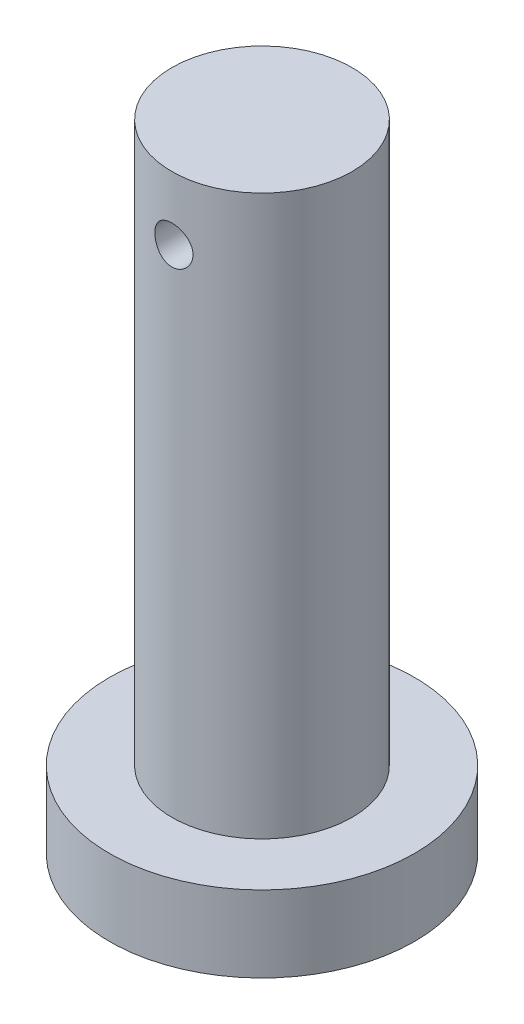
ISO-10303-21;
HEADER;
FILE_DESCRIPTION(('STEP AP214'),'2;1');
FILE_NAME('part.step','',(''),(''),'','','');
FILE_SCHEMA(('AUTOMOTIVE_DESIGN { 1 0 10303 214 1 1 1 1 }'));
ENDSEC;
DATA;
#1=APPLICATION_CONTEXT('core data for automotive mechanical design processes');
#2=APPLICATION_PROTOCOL_DEFINITION('international standard','automotive_design',2000,#1);
#3=PRODUCT_CONTEXT('',#1,'mechanical');
#4=PRODUCT('Part','Part','',(#3));
#5=PRODUCT_RELATED_PRODUCT_CATEGORY('part','',(#4));
#6=PRODUCT_DEFINITION_FORMATION('','',#4);
#7=PRODUCT_DEFINITION_CONTEXT('part definition',#1,'design');
#8=PRODUCT_DEFINITION('design','',#6,#7);
#9=PRODUCT_DEFINITION_SHAPE('','',#8);
#10=(LENGTH_UNIT() NAMED_UNIT(*) SI_UNIT(.MILLI.,.METRE.));
#11=(NAMED_UNIT(*) PLANE_ANGLE_UNIT() SI_UNIT($,.RADIAN.));
#12=(NAMED_UNIT(*) SI_UNIT($,.STERADIAN.) SOLID_ANGLE_UNIT());
#13=UNCERTAINTY_MEASURE_WITH_UNIT(LENGTH_MEASURE(1.E-05),#10,'distance_accuracy_value','');
#14=(GEOMETRIC_REPRESENTATION_CONTEXT(3) GLOBAL_UNCERTAINTY_ASSIGNED_CONTEXT((#13)) GLOBAL_UNIT_ASSIGNED_CONTEXT((#10,
#11,#12)) REPRESENTATION_CONTEXT('',''));
#15=CARTESIAN_POINT('',(0.,0.,0.));
#16=DIRECTION('',(0.,0.,1.));
#17=DIRECTION('',(1.,0.,0.));
#18=AXIS2_PLACEMENT_3D('',#15,#16,#17);
#19=CARTESIAN_POINT('',(0.,0.,0.));
#20=DIRECTION('',(0.,1.,0.));
#21=DIRECTION('',(-1.,0.,0.));
#22=AXIS2_PLACEMENT_3D('',#19,#20,#21);
#23=PLANE('',#22);
#24=CARTESIAN_POINT('',(0.,0.,0.));
#25=DIRECTION('',(0.,1.,0.));
#26=DIRECTION('',(-1.,0.,0.));
#27=AXIS2_PLACEMENT_3D('',#24,#25,#26);
#28=CIRCLE('',#27,30.);
#29=CARTESIAN_POINT('',(-30.,0.,0.));
#30=VERTEX_POINT('',#29);
#31=EDGE_CURVE('E12',#30,#30,#28,.T.);
#32=ORIENTED_EDGE('',*,*,#31,.F.);
#33=EDGE_LOOP('',(#32));
#34=FACE_BOUND('',#33,.T.);
#35=ADVANCED_FACE('F43',(#34),#23,.F.);
#36=CARTESIAN_POINT('',(0.,125.,0.));
#37=DIRECTION('',(0.,1.,0.));
#38=DIRECTION('',(-1.,0.,0.));
#39=AXIS2_PLACEMENT_3D('',#36,#37,#38);
#40=CYLINDRICAL_SURFACE('',#39,30.);
#41=CARTESIAN_POINT('',(0.,15.,0.));
#42=DIRECTION('',(0.,1.,0.));
#43=DIRECTION('',(-1.,0.,0.));
#44=AXIS2_PLACEMENT_3D('',#41,#42,#43);
#45=CIRCLE('',#44,30.);
#46=CARTESIAN_POINT('',(-30.,15.,0.));
#47=VERTEX_POINT('',#46);
#48=EDGE_CURVE('E55',#47,#47,#45,.T.);
#49=ORIENTED_EDGE('',*,*,#48,.F.);
#50=EDGE_LOOP('',(#49));
#51=FACE_BOUND('',#50,.T.);
#52=ORIENTED_EDGE('',*,*,#31,.T.);
#53=EDGE_LOOP('',(#52));
#54=FACE_BOUND('',#53,.T.);
#55=ADVANCED_FACE('F87',(#51,#54),#40,.T.);
#56=CARTESIAN_POINT('',(30.,15.,0.));
#57=DIRECTION('',(0.,-1.,0.));
#58=DIRECTION('',(1.,0.,0.));
#59=AXIS2_PLACEMENT_3D('',#56,#57,#58);
#60=PLANE('',#59);
#61=CARTESIAN_POINT('',(0.,15.,0.));
#62=DIRECTION('',(0.,1.,0.));
#63=DIRECTION('',(-1.,0.,0.));
#64=AXIS2_PLACEMENT_3D('',#61,#62,#63);
#65=CIRCLE('',#64,17.7222);
#66=CARTESIAN_POINT('',(-17.7222,15.,0.));
#67=VERTEX_POINT('',#66);
#68=EDGE_CURVE('E60',#67,#67,#65,.T.);
#69=ORIENTED_EDGE('',*,*,#68,.F.);
#70=EDGE_LOOP('',(#69));
#71=FACE_BOUND('',#70,.T.);
#72=ORIENTED_EDGE('',*,*,#48,.T.);
#73=EDGE_LOOP('',(#72));
#74=FACE_BOUND('',#73,.T.);
#75=ADVANCED_FACE('F83',(#71,#74),#60,.F.);
#76=CARTESIAN_POINT('',(0.,125.,0.));
#77=DIRECTION('',(0.,1.,0.));
#78=DIRECTION('',(-1.,0.,0.));
#79=AXIS2_PLACEMENT_3D('',#76,#77,#78);
#80=CYLINDRICAL_SURFACE('',#79,17.7222);
#81=CARTESIAN_POINT('',(3.75,112.5,-17.3209085454545));
#82=CARTESIAN_POINT('',(3.74999262317846,112.708093377559,-17.3209127403599));
#83=CARTESIAN_POINT('',(3.73261997860774,112.916277044266,-17.3246994128075));
#84=CARTESIAN_POINT('',(3.66365734999549,113.326736132959,-17.3394113210448));
#85=CARTESIAN_POINT('',(3.61204159866976,113.529006985906,-17.3503419324201));
#86=CARTESIAN_POINT('',(3.47628071020748,113.921643316706,-17.378049597833));
#87=CARTESIAN_POINT('',(3.39216995789181,114.112021132715,-17.3948204701126));
#88=CARTESIAN_POINT('',(3.19390346373044,114.475963940299,-17.4323116003607));
#89=CARTESIAN_POINT('',(3.0797487513,114.649529507645,-17.4530317230067));
#90=CARTESIAN_POINT('',(2.8227102243032,114.977671220932,-17.4964528436146));
#91=CARTESIAN_POINT('',(2.67944149998642,115.131942743113,-17.5191777906157));
#92=CARTESIAN_POINT('',(2.36907303755115,115.4144525696,-17.5638379340189));
#93=CARTESIAN_POINT('',(2.20197152130571,115.542688929732,-17.5857730713415));
#94=CARTESIAN_POINT('',(1.84664821708078,115.770684358623,-17.6266419499506));
#95=CARTESIAN_POINT('',(1.6582353617803,115.870151796008,-17.6455441445425));
#96=CARTESIAN_POINT('',(1.2669029854327,116.035901031209,-17.6779474301966));
#97=CARTESIAN_POINT('',(1.0639849888309,116.102186310525,-17.6914490878576));
#98=CARTESIAN_POINT('',(0.652567580719971,116.198735348537,-17.7113608065571));
#99=CARTESIAN_POINT('',(0.444194041340725,116.229514231484,-17.7178721830305));
#100=CARTESIAN_POINT('',(0.0251460275708707,116.255786023133,-17.7234202773815));
#101=CARTESIAN_POINT('',(-0.185528197367934,116.251282720109,-17.7224577977324));
#102=CARTESIAN_POINT('',(-0.599650668847649,116.207504380898,-17.7132444762233));
#103=CARTESIAN_POINT('',(-0.803160564023209,116.168784436707,-17.7051099896601));
#104=CARTESIAN_POINT('',(-1.20072724293187,116.058554884073,-17.6825986819167));
#105=CARTESIAN_POINT('',(-1.39478361731766,115.987043857135,-17.668221590692));
#106=CARTESIAN_POINT('',(-1.76949226205793,115.812762041542,-17.6346515461538));
#107=CARTESIAN_POINT('',(-1.95004234186692,115.709778093599,-17.6154259149491));
#108=CARTESIAN_POINT('',(-2.29150208321449,115.47563223176,-17.574271331142));
#109=CARTESIAN_POINT('',(-2.4524092261398,115.344466710367,-17.5523420325989));
#110=CARTESIAN_POINT('',(-2.75331424766757,115.054649805473,-17.5076914056489));
#111=CARTESIAN_POINT('',(-2.89284352514331,114.895512582164,-17.4849629705469));
#112=CARTESIAN_POINT('',(-3.14331748073307,114.555864767729,-17.4416780316321));
#113=CARTESIAN_POINT('',(-3.25426148100088,114.37535366991,-17.4211215793306));
#114=CARTESIAN_POINT('',(-3.44460544567756,113.997357726212,-17.3844910940221));
#115=CARTESIAN_POINT('',(-3.52392183288318,113.799829563272,-17.3684289703895));
#116=CARTESIAN_POINT('',(-3.64809745225986,113.393829338666,-17.3427742763144));
#117=CARTESIAN_POINT('',(-3.69296176518216,113.185358895537,-17.3331807519537));
#118=CARTESIAN_POINT('',(-3.74624324397612,112.76766009111,-17.321742710072));
#119=CARTESIAN_POINT('',(-3.75534053082154,112.558522345409,-17.3197536124913));
#120=CARTESIAN_POINT('',(-3.73866669739234,112.141718310905,-17.3233603789464));
#121=CARTESIAN_POINT('',(-3.71289780756497,111.934051928831,-17.3289557577907));
#122=CARTESIAN_POINT('',(-3.62781175603404,111.528421461802,-17.3469649281265));
#123=CARTESIAN_POINT('',(-3.56886480360997,111.330376071787,-17.3593034347225));
#124=CARTESIAN_POINT('',(-3.41949479846595,110.946972633265,-17.3893414522287));
#125=CARTESIAN_POINT('',(-3.32906889399048,110.76161573606,-17.4070414488305));
#126=CARTESIAN_POINT('',(-3.11779340887312,110.405894821698,-17.4461285497627));
#127=CARTESIAN_POINT('',(-2.99652228144576,110.235786744496,-17.467565329004));
#128=CARTESIAN_POINT('',(-2.72755439164384,109.918086323327,-17.5115775650937));
#129=CARTESIAN_POINT('',(-2.57985456808568,109.770496591289,-17.5341531536303));
#130=CARTESIAN_POINT('',(-2.25915377249306,109.499406461982,-17.5783730388198));
#131=CARTESIAN_POINT('',(-2.08575840667884,109.376368268524,-17.5999943920104));
#132=CARTESIAN_POINT('',(-1.72036426394339,109.161168561999,-17.6394568181403));
#133=CARTESIAN_POINT('',(-1.52836632473976,109.069005659377,-17.6572980611917));
#134=CARTESIAN_POINT('',(-1.13237181293258,108.918828173017,-17.6870928075675));
#135=CARTESIAN_POINT('',(-0.928456948272551,108.86060555932,-17.6990821038446));
#136=CARTESIAN_POINT('',(-0.51345994497011,108.779307778374,-17.7159763748215));
#137=CARTESIAN_POINT('',(-0.30237878201117,108.756227845952,-17.7208823099854));
#138=CARTESIAN_POINT('',(0.116560832719891,108.746073283603,-17.7230308401985));
#139=CARTESIAN_POINT('',(0.324402062843799,108.758306724024,-17.7204207074236));
#140=CARTESIAN_POINT('',(0.734994933660253,108.816891729548,-17.7081436067735));
#141=CARTESIAN_POINT('',(0.937746654628512,108.863242756171,-17.698476750275));
#142=CARTESIAN_POINT('',(1.33191041798981,108.988424776035,-17.6731806640817));
#143=CARTESIAN_POINT('',(1.52335293699508,109.067163450386,-17.6575683907202));
#144=CARTESIAN_POINT('',(1.89040430753438,109.254793312458,-17.6220539549752));
#145=CARTESIAN_POINT('',(2.066011728651,109.363687220555,-17.6021514055916));
#146=CARTESIAN_POINT('',(2.39980151247035,109.610823120376,-17.5597884397093));
#147=CARTESIAN_POINT('',(2.55761616742307,109.749555050576,-17.5372886507353));
#148=CARTESIAN_POINT('',(2.84796223724989,110.051433301696,-17.4924874475652));
#149=CARTESIAN_POINT('',(2.98048759586125,110.214585454104,-17.4701860821035));
#150=CARTESIAN_POINT('',(3.21805989106317,110.563091032504,-17.4280016019896));
#151=CARTESIAN_POINT('',(3.32274774875285,110.748693468642,-17.408151706626));
#152=CARTESIAN_POINT('',(3.49928129047304,111.135232094083,-17.3735304123889));
#153=CARTESIAN_POINT('',(3.57115555676738,111.336154759961,-17.3587545965321));
#154=CARTESIAN_POINT('',(3.6667550315034,111.69781940775,-17.3387719502576));
#155=CARTESIAN_POINT('',(3.69791362140268,111.856558370175,-17.3321164661325));
#156=CARTESIAN_POINT('',(3.73953852764504,112.176846817698,-17.3231832284598));
#157=CARTESIAN_POINT('',(3.75000572878646,112.338396182321,-17.3209052877212));
#158=CARTESIAN_POINT('',(3.75,112.5,-17.3209085454545));
#159=B_SPLINE_CURVE_WITH_KNOTS('',3,(#81,#82,#83,#84,#85,#86,#87,#88,#89,#90,#91,#92,#93,#94,
#95,#96,#97,#98,#99,#100,#101,#102,#103,#104,#105,#106,#107,#108,#109,#110,#111,#112,#113,#114,
#115,#116,#117,#118,#119,#120,#121,#122,#123,#124,#125,#126,#127,#128,#129,#130,#131,#132,#133,
#134,#135,#136,#137,#138,#139,#140,#141,#142,#143,#144,#145,#146,#147,#148,#149,#150,#151,#152,
#153,#154,#155,#156,#157,#158),.UNSPECIFIED.,.T.,.F.,(4,2,2,2,2,2,2,2,2,2,2,2,2,2,2,2,2,2,2,2,2,
2,2,2,2,2,2,2,2,2,2,2,2,2,2,2,2,2,4),(0.,0.623688090543544,1.24784602759236,1.87134530840722,
2.49482322865153,3.12715391539679,3.75953180403847,4.39811185432496,5.03662489022359,
5.66575306846343,6.29481369768977,6.91385275136083,7.53291858628581,8.1562737999039,
8.77970885623473,9.41529368384851,10.0508935817771,10.6881621200715,11.3253366603958,
11.9503347936719,12.5752929466693,13.1934120958477,13.8115872565353,14.4387129619278,
15.0659113531267,15.7039879007302,16.3420357275908,16.9761304972284,17.6101392790794,
18.2318101300843,18.853471169442,19.4733723505521,20.0933294726495,20.7243716110697,
21.3555646818813,21.9945428733454,22.6329634162214,23.1173358066246,23.6016874840072),.UNSPECIFIED.);
#160=CARTESIAN_POINT('',(3.75,112.5,-17.3209085454545));
#161=VERTEX_POINT('',#160);
#162=EDGE_CURVE('E46',#161,#161,#159,.T.);
#163=ORIENTED_EDGE('',*,*,#162,.T.);
#164=EDGE_LOOP('',(#163));
#165=FACE_BOUND('',#164,.T.);
#166=CARTESIAN_POINT('',(3.75,112.5,17.3209085454545));
#167=CARTESIAN_POINT('',(3.74999262317846,112.291906622441,17.3209127403599));
#168=CARTESIAN_POINT('',(3.73261997860774,112.083722955734,17.3246994128075));
#169=CARTESIAN_POINT('',(3.6636573499955,111.673263867041,17.3394113210448));
#170=CARTESIAN_POINT('',(3.61204159866976,111.470993014094,17.3503419324201));
#171=CARTESIAN_POINT('',(3.47628071020748,111.078356683294,17.378049597833));
#172=CARTESIAN_POINT('',(3.39216995789181,110.887978867285,17.3948204701126));
#173=CARTESIAN_POINT('',(3.19390346373044,110.524036059701,17.4323116003607));
#174=CARTESIAN_POINT('',(3.0797487513,110.350470492355,17.4530317230067));
#175=CARTESIAN_POINT('',(2.82271022430321,110.022328779068,17.4964528436146));
#176=CARTESIAN_POINT('',(2.67944149998643,109.868057256887,17.5191777906157));
#177=CARTESIAN_POINT('',(2.36907303755117,109.5855474304,17.5638379340189));
#178=CARTESIAN_POINT('',(2.20197152130572,109.457311070268,17.5857730713415));
#179=CARTESIAN_POINT('',(1.84664821708078,109.229315641377,17.6266419499506));
#180=CARTESIAN_POINT('',(1.6582353617803,109.129848203993,17.6455441445425));
#181=CARTESIAN_POINT('',(1.2669029854327,108.964098968791,17.6779474301966));
#182=CARTESIAN_POINT('',(1.0639849888309,108.897813689475,17.6914490878576));
#183=CARTESIAN_POINT('',(0.652567580719972,108.801264651463,17.7113608065571));
#184=CARTESIAN_POINT('',(0.444194041340725,108.770485768516,17.7178721830305));
#185=CARTESIAN_POINT('',(0.0251460275708711,108.744213976867,17.7234202773815));
#186=CARTESIAN_POINT('',(-0.185528197367934,108.748717279891,17.7224577977324));
#187=CARTESIAN_POINT('',(-0.599650668847648,108.792495619102,17.7132444762233));
#188=CARTESIAN_POINT('',(-0.803160564023209,108.831215563293,17.7051099896601));
#189=CARTESIAN_POINT('',(-1.20072724293187,108.941445115927,17.6825986819167));
#190=CARTESIAN_POINT('',(-1.39478361731766,109.012956142865,17.668221590692));
#191=CARTESIAN_POINT('',(-1.76949226205793,109.187237958458,17.6346515461538));
#192=CARTESIAN_POINT('',(-1.95004234186692,109.290221906401,17.6154259149491));
#193=CARTESIAN_POINT('',(-2.29150208321449,109.52436776824,17.574271331142));
#194=CARTESIAN_POINT('',(-2.4524092261398,109.655533289633,17.5523420325989));
#195=CARTESIAN_POINT('',(-2.75331424766757,109.945350194527,17.5076914056489));
#196=CARTESIAN_POINT('',(-2.89284352514331,110.104487417836,17.4849629705469));
#197=CARTESIAN_POINT('',(-3.14331748073307,110.444135232271,17.4416780316321));
#198=CARTESIAN_POINT('',(-3.25426148100088,110.62464633009,17.4211215793306));
#199=CARTESIAN_POINT('',(-3.44460544567756,111.002642273789,17.3844910940221));
#200=CARTESIAN_POINT('',(-3.52392183288318,111.200170436728,17.3684289703895));
#201=CARTESIAN_POINT('',(-3.64809745225986,111.606170661334,17.3427742763144));
#202=CARTESIAN_POINT('',(-3.69296176518216,111.814641104463,17.3331807519537));
#203=CARTESIAN_POINT('',(-3.74624324397612,112.23233990889,17.321742710072));
#204=CARTESIAN_POINT('',(-3.75534053082154,112.441477654591,17.3197536124913));
#205=CARTESIAN_POINT('',(-3.73866669739234,112.858281689095,17.3233603789464));
#206=CARTESIAN_POINT('',(-3.71289780756497,113.065948071169,17.3289557577907));
#207=CARTESIAN_POINT('',(-3.62781175603405,113.471578538198,17.3469649281265));
#208=CARTESIAN_POINT('',(-3.56886480360998,113.669623928213,17.3593034347225));
#209=CARTESIAN_POINT('',(-3.41949479846596,114.053027366735,17.3893414522287));
#210=CARTESIAN_POINT('',(-3.32906889399049,114.23838426394,17.4070414488305));
#211=CARTESIAN_POINT('',(-3.11779340887312,114.594105178302,17.4461285497627));
#212=CARTESIAN_POINT('',(-2.99652228144576,114.764213255504,17.467565329004));
#213=CARTESIAN_POINT('',(-2.72755439164384,115.081913676673,17.5115775650937));
#214=CARTESIAN_POINT('',(-2.57985456808568,115.229503408711,17.5341531536303));
#215=CARTESIAN_POINT('',(-2.25915377249306,115.500593538018,17.5783730388198));
#216=CARTESIAN_POINT('',(-2.08575840667884,115.623631731476,17.5999943920104));
#217=CARTESIAN_POINT('',(-1.7203642639434,115.838831438001,17.6394568181403));
#218=CARTESIAN_POINT('',(-1.52836632473976,115.930994340623,17.6572980611917));
#219=CARTESIAN_POINT('',(-1.13237181293258,116.081171826983,17.6870928075675));
#220=CARTESIAN_POINT('',(-0.928456948272553,116.13939444068,17.6990821038446));
#221=CARTESIAN_POINT('',(-0.513459944970111,116.220692221626,17.7159763748215));
#222=CARTESIAN_POINT('',(-0.302378782011169,116.243772154048,17.7208823099854));
#223=CARTESIAN_POINT('',(0.116560832719893,116.253926716397,17.7230308401985));
#224=CARTESIAN_POINT('',(0.324402062843802,116.241693275976,17.7204207074236));
#225=CARTESIAN_POINT('',(0.734994933660255,116.183108270452,17.7081436067735));
#226=CARTESIAN_POINT('',(0.937746654628513,116.136757243829,17.698476750275));
#227=CARTESIAN_POINT('',(1.33191041798981,116.011575223965,17.6731806640817));
#228=CARTESIAN_POINT('',(1.52335293699509,115.932836549614,17.6575683907202));
#229=CARTESIAN_POINT('',(1.89040430753438,115.745206687542,17.6220539549752));
#230=CARTESIAN_POINT('',(2.066011728651,115.636312779445,17.6021514055916));
#231=CARTESIAN_POINT('',(2.39980151247035,115.389176879624,17.5597884397093));
#232=CARTESIAN_POINT('',(2.55761616742307,115.250444949424,17.5372886507353));
#233=CARTESIAN_POINT('',(2.84796223724989,114.948566698304,17.4924874475652));
#234=CARTESIAN_POINT('',(2.98048759586125,114.785414545896,17.4701860821035));
#235=CARTESIAN_POINT('',(3.21805989106317,114.436908967496,17.4280016019896));
#236=CARTESIAN_POINT('',(3.32274774875286,114.251306531358,17.408151706626));
#237=CARTESIAN_POINT('',(3.49928129047305,113.864767905917,17.3735304123889));
#238=CARTESIAN_POINT('',(3.57115555676738,113.663845240039,17.3587545965321));
#239=CARTESIAN_POINT('',(3.6667550315034,113.30218059225,17.3387719502576));
#240=CARTESIAN_POINT('',(3.69791362140268,113.143441629825,17.3321164661325));
#241=CARTESIAN_POINT('',(3.73953852764504,112.823153182302,17.3231832284598));
#242=CARTESIAN_POINT('',(3.75000572878646,112.661603817679,17.3209052877212));
#243=CARTESIAN_POINT('',(3.75,112.5,17.3209085454545));
#244=B_SPLINE_CURVE_WITH_KNOTS('',3,(#166,#167,#168,#169,#170,#171,#172,#173,#174,#175,#176,
#177,#178,#179,#180,#181,#182,#183,#184,#185,#186,#187,#188,#189,#190,#191,#192,#193,#194,#195,
#196,#197,#198,#199,#200,#201,#202,#203,#204,#205,#206,#207,#208,#209,#210,#211,#212,#213,#214,
#215,#216,#217,#218,#219,#220,#221,#222,#223,#224,#225,#226,#227,#228,#229,#230,#231,#232,#233,
#234,#235,#236,#237,#238,#239,#240,#241,#242,#243),.UNSPECIFIED.,.T.,.F.,(4,2,2,2,2,2,2,2,2,2,2,
2,2,2,2,2,2,2,2,2,2,2,2,2,2,2,2,2,2,2,2,2,2,2,2,2,2,2,4),(0.,0.62368809054353,1.24784602759236,
1.87134530840722,2.49482322865153,3.12715391539676,3.75953180403847,4.39811185432495,
5.03662489022359,5.66575306846343,6.29481369768977,6.91385275136083,7.53291858628581,
8.1562737999039,8.77970885623473,9.4152936838485,10.0508935817771,10.6881621200715,
11.3253366603958,11.9503347936718,12.5752929466693,13.1934120958477,13.8115872565353,
14.4387129619278,15.0659113531267,15.7039879007302,16.3420357275909,16.9761304972284,
17.6101392790794,18.2318101300843,18.853471169442,19.4733723505521,20.0933294726496,
20.7243716110697,21.3555646818814,21.9945428733455,22.6329634162214,23.1173358066246,
23.6016874840072),.UNSPECIFIED.);
#245=CARTESIAN_POINT('',(3.75,112.5,17.3209085454545));
#246=VERTEX_POINT('',#245);
#247=EDGE_CURVE('E63',#246,#246,#244,.T.);
#248=ORIENTED_EDGE('',*,*,#247,.T.);
#249=EDGE_LOOP('',(#248));
#250=FACE_BOUND('',#249,.T.);
#251=CARTESIAN_POINT('',(0.,125.,0.));
#252=DIRECTION('',(0.,1.,0.));
#253=DIRECTION('',(-1.,0.,0.));
#254=AXIS2_PLACEMENT_3D('',#251,#252,#253);
#255=CIRCLE('',#254,17.7222);
#256=CARTESIAN_POINT('',(-17.7222,125.,0.));
#257=VERTEX_POINT('',#256);
#258=EDGE_CURVE('E104',#257,#257,#255,.T.);
#259=ORIENTED_EDGE('',*,*,#258,.F.);
#260=EDGE_LOOP('',(#259));
#261=FACE_BOUND('',#260,.T.);
#262=ORIENTED_EDGE('',*,*,#68,.T.);
#263=EDGE_LOOP('',(#262));
#264=FACE_BOUND('',#263,.T.);
#265=ADVANCED_FACE('F68',(#165,#250,#261,#264),#80,.T.);
#266=CARTESIAN_POINT('',(17.7222,125.,0.));
#267=DIRECTION('',(0.,-1.,0.));
#268=DIRECTION('',(1.,0.,0.));
#269=AXIS2_PLACEMENT_3D('',#266,#267,#268);
#270=PLANE('',#269);
#271=ORIENTED_EDGE('',*,*,#258,.T.);
#272=EDGE_LOOP('',(#271));
#273=FACE_BOUND('',#272,.T.);
#274=ADVANCED_FACE('F75',(#273),#270,.F.);
#275=CARTESIAN_POINT('',(0.,112.5,-30.));
#276=DIRECTION('',(0.,0.,1.));
#277=DIRECTION('',(1.,0.,0.));
#278=AXIS2_PLACEMENT_3D('',#275,#276,#277);
#279=CYLINDRICAL_SURFACE('',#278,3.75);
#280=ORIENTED_EDGE('',*,*,#247,.F.);
#281=EDGE_LOOP('',(#280));
#282=FACE_BOUND('',#281,.T.);
#283=ORIENTED_EDGE('',*,*,#162,.F.);
#284=EDGE_LOOP('',(#283));
#285=FACE_BOUND('',#284,.T.);
#286=ADVANCED_FACE('F72',(#282,#285),#279,.F.);
#287=CLOSED_SHELL('',(#35,#55,#75,#265,#274,#286));
#288=MANIFOLD_SOLID_BREP('B2',#287);
#289=ADVANCED_BREP_SHAPE_REPRESENTATION('',(#18,#288),#14);
#290=SHAPE_DEFINITION_REPRESENTATION(#9,#289);
ENDSEC;
END-ISO-10303-21;
